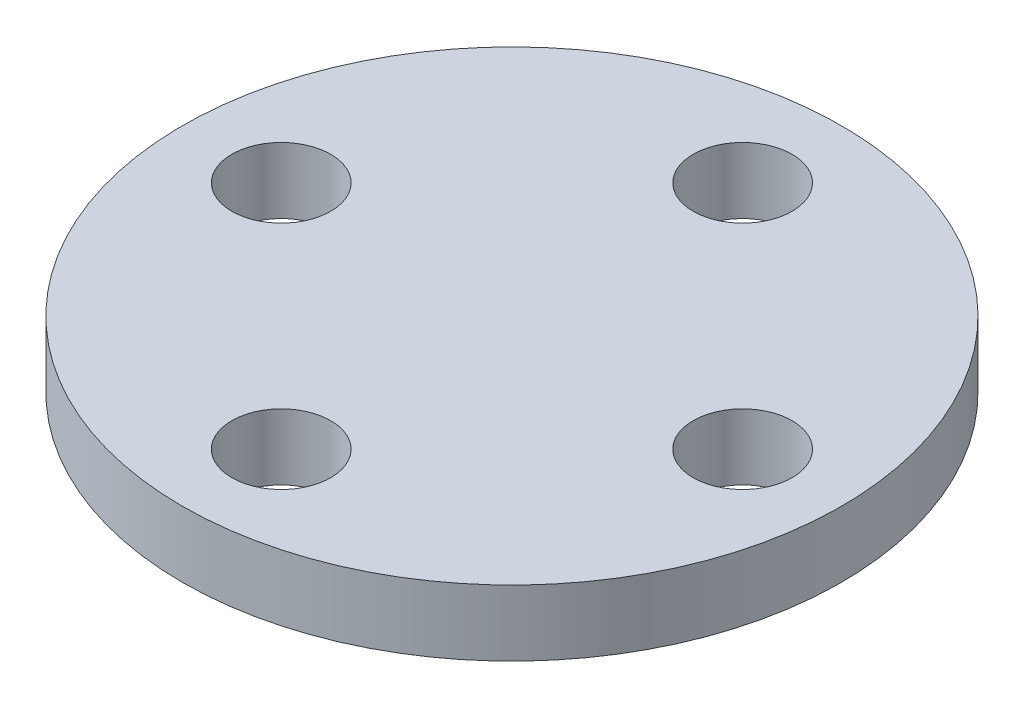
ISO-10303-21;
HEADER;
FILE_DESCRIPTION(('STEP AP214'),'2;1');
FILE_NAME('part.step','',(''),(''),'','','');
FILE_SCHEMA(('AUTOMOTIVE_DESIGN { 1 0 10303 214 1 1 1 1 }'));
ENDSEC;
DATA;
#1=APPLICATION_CONTEXT('core data for automotive mechanical design processes');
#2=APPLICATION_PROTOCOL_DEFINITION('international standard','automotive_design',2000,#1);
#3=PRODUCT_CONTEXT('',#1,'mechanical');
#4=PRODUCT('Part','Part','',(#3));
#5=PRODUCT_RELATED_PRODUCT_CATEGORY('part','',(#4));
#6=PRODUCT_DEFINITION_FORMATION('','',#4);
#7=PRODUCT_DEFINITION_CONTEXT('part definition',#1,'design');
#8=PRODUCT_DEFINITION('design','',#6,#7);
#9=PRODUCT_DEFINITION_SHAPE('','',#8);
#10=(LENGTH_UNIT() NAMED_UNIT(*) SI_UNIT(.MILLI.,.METRE.));
#11=(NAMED_UNIT(*) PLANE_ANGLE_UNIT() SI_UNIT($,.RADIAN.));
#12=(NAMED_UNIT(*) SI_UNIT($,.STERADIAN.) SOLID_ANGLE_UNIT());
#13=UNCERTAINTY_MEASURE_WITH_UNIT(LENGTH_MEASURE(1.E-05),#10,'distance_accuracy_value','');
#14=(GEOMETRIC_REPRESENTATION_CONTEXT(3) GLOBAL_UNCERTAINTY_ASSIGNED_CONTEXT((#13)) GLOBAL_UNIT_ASSIGNED_CONTEXT((#10,
#11,#12)) REPRESENTATION_CONTEXT('',''));
#15=CARTESIAN_POINT('',(0.,0.,0.));
#16=DIRECTION('',(0.,0.,1.));
#17=DIRECTION('',(1.,0.,0.));
#18=AXIS2_PLACEMENT_3D('',#15,#16,#17);
#19=CARTESIAN_POINT('',(0.,0.,0.));
#20=DIRECTION('',(0.,1.,0.));
#21=DIRECTION('',(0.,0.,1.));
#22=AXIS2_PLACEMENT_3D('',#19,#20,#21);
#23=PLANE('',#22);
#24=CARTESIAN_POINT('',(0.,0.,7.));
#25=DIRECTION('',(0.,1.,0.));
#26=DIRECTION('',(0.,0.,1.));
#27=AXIS2_PLACEMENT_3D('',#24,#25,#26);
#28=CIRCLE('',#27,1.5);
#29=CARTESIAN_POINT('',(0.,0.,8.5));
#30=VERTEX_POINT('',#29);
#31=EDGE_CURVE('E61',#30,#30,#28,.T.);
#32=ORIENTED_EDGE('',*,*,#31,.T.);
#33=EDGE_LOOP('',(#32));
#34=FACE_BOUND('',#33,.T.);
#35=CARTESIAN_POINT('',(0.,0.,-7.));
#36=DIRECTION('',(0.,1.,0.));
#37=DIRECTION('',(0.,0.,1.));
#38=AXIS2_PLACEMENT_3D('',#35,#36,#37);
#39=CIRCLE('',#38,1.5);
#40=CARTESIAN_POINT('',(0.,0.,-5.5));
#41=VERTEX_POINT('',#40);
#42=EDGE_CURVE('E49',#41,#41,#39,.T.);
#43=ORIENTED_EDGE('',*,*,#42,.T.);
#44=EDGE_LOOP('',(#43));
#45=FACE_BOUND('',#44,.T.);
#46=CARTESIAN_POINT('',(0.,0.,0.));
#47=DIRECTION('',(0.,1.,0.));
#48=DIRECTION('',(0.,0.,1.));
#49=AXIS2_PLACEMENT_3D('',#46,#47,#48);
#50=CIRCLE('',#49,10.);
#51=CARTESIAN_POINT('',(0.,0.,10.));
#52=VERTEX_POINT('',#51);
#53=EDGE_CURVE('E42',#52,#52,#50,.T.);
#54=ORIENTED_EDGE('',*,*,#53,.F.);
#55=EDGE_LOOP('',(#54));
#56=FACE_BOUND('',#55,.T.);
#57=CARTESIAN_POINT('',(7.,0.,0.));
#58=DIRECTION('',(0.,1.,0.));
#59=DIRECTION('',(0.,0.,1.));
#60=AXIS2_PLACEMENT_3D('',#57,#58,#59);
#61=CIRCLE('',#60,1.5);
#62=CARTESIAN_POINT('',(7.,0.,1.5));
#63=VERTEX_POINT('',#62);
#64=EDGE_CURVE('E55',#63,#63,#61,.T.);
#65=ORIENTED_EDGE('',*,*,#64,.T.);
#66=EDGE_LOOP('',(#65));
#67=FACE_BOUND('',#66,.T.);
#68=CARTESIAN_POINT('',(-7.,0.,0.));
#69=DIRECTION('',(0.,1.,0.));
#70=DIRECTION('',(0.,0.,1.));
#71=AXIS2_PLACEMENT_3D('',#68,#69,#70);
#72=CIRCLE('',#71,1.5);
#73=CARTESIAN_POINT('',(-7.,0.,1.5));
#74=VERTEX_POINT('',#73);
#75=EDGE_CURVE('E67',#74,#74,#72,.T.);
#76=ORIENTED_EDGE('',*,*,#75,.T.);
#77=EDGE_LOOP('',(#76));
#78=FACE_BOUND('',#77,.T.);
#79=CARTESIAN_POINT('',(0.,0.,0.));
#80=DIRECTION('',(0.,1.,0.));
#81=DIRECTION('',(0.,0.,1.));
#82=AXIS2_PLACEMENT_3D('',#79,#80,#81);
#83=CIRCLE('',#82,4.);
#84=CARTESIAN_POINT('',(0.,0.,4.));
#85=VERTEX_POINT('',#84);
#86=EDGE_CURVE('E10',#85,#85,#83,.F.);
#87=ORIENTED_EDGE('',*,*,#86,.F.);
#88=EDGE_LOOP('',(#87));
#89=FACE_BOUND('',#88,.T.);
#90=ADVANCED_FACE('F31',(#34,#45,#56,#67,#78,#89),#23,.F.);
#91=CARTESIAN_POINT('',(0.,2.,0.));
#92=DIRECTION('',(0.,1.,0.));
#93=DIRECTION('',(0.,0.,1.));
#94=AXIS2_PLACEMENT_3D('',#91,#92,#93);
#95=PLANE('',#94);
#96=CARTESIAN_POINT('',(0.,2.,7.));
#97=DIRECTION('',(0.,1.,0.));
#98=DIRECTION('',(0.,0.,1.));
#99=AXIS2_PLACEMENT_3D('',#96,#97,#98);
#100=CIRCLE('',#99,1.5);
#101=CARTESIAN_POINT('',(0.,2.,8.5));
#102=VERTEX_POINT('',#101);
#103=EDGE_CURVE('E58',#102,#102,#100,.T.);
#104=ORIENTED_EDGE('',*,*,#103,.F.);
#105=EDGE_LOOP('',(#104));
#106=FACE_BOUND('',#105,.T.);
#107=CARTESIAN_POINT('',(0.,2.,-7.));
#108=DIRECTION('',(0.,1.,0.));
#109=DIRECTION('',(0.,0.,1.));
#110=AXIS2_PLACEMENT_3D('',#107,#108,#109);
#111=CIRCLE('',#110,1.5);
#112=CARTESIAN_POINT('',(0.,2.,-5.5));
#113=VERTEX_POINT('',#112);
#114=EDGE_CURVE('E47',#113,#113,#111,.T.);
#115=ORIENTED_EDGE('',*,*,#114,.F.);
#116=EDGE_LOOP('',(#115));
#117=FACE_BOUND('',#116,.T.);
#118=CARTESIAN_POINT('',(0.,2.,0.));
#119=DIRECTION('',(0.,1.,0.));
#120=DIRECTION('',(0.,0.,1.));
#121=AXIS2_PLACEMENT_3D('',#118,#119,#120);
#122=CIRCLE('',#121,10.);
#123=CARTESIAN_POINT('',(0.,2.,10.));
#124=VERTEX_POINT('',#123);
#125=EDGE_CURVE('E38',#124,#124,#122,.T.);
#126=ORIENTED_EDGE('',*,*,#125,.T.);
#127=EDGE_LOOP('',(#126));
#128=FACE_BOUND('',#127,.T.);
#129=CARTESIAN_POINT('',(7.,2.,0.));
#130=DIRECTION('',(0.,1.,0.));
#131=DIRECTION('',(0.,0.,1.));
#132=AXIS2_PLACEMENT_3D('',#129,#130,#131);
#133=CIRCLE('',#132,1.5);
#134=CARTESIAN_POINT('',(7.,2.,1.5));
#135=VERTEX_POINT('',#134);
#136=EDGE_CURVE('E52',#135,#135,#133,.T.);
#137=ORIENTED_EDGE('',*,*,#136,.F.);
#138=EDGE_LOOP('',(#137));
#139=FACE_BOUND('',#138,.T.);
#140=CARTESIAN_POINT('',(-7.,2.,0.));
#141=DIRECTION('',(0.,1.,0.));
#142=DIRECTION('',(0.,0.,1.));
#143=AXIS2_PLACEMENT_3D('',#140,#141,#142);
#144=CIRCLE('',#143,1.5);
#145=CARTESIAN_POINT('',(-7.,2.,1.5));
#146=VERTEX_POINT('',#145);
#147=EDGE_CURVE('E64',#146,#146,#144,.T.);
#148=ORIENTED_EDGE('',*,*,#147,.F.);
#149=EDGE_LOOP('',(#148));
#150=FACE_BOUND('',#149,.T.);
#151=ADVANCED_FACE('F102',(#106,#117,#128,#139,#150),#95,.T.);
#152=CARTESIAN_POINT('',(0.,2.,0.));
#153=DIRECTION('',(0.,-1.,0.));
#154=DIRECTION('',(0.,0.,-1.));
#155=AXIS2_PLACEMENT_3D('',#152,#153,#154);
#156=CYLINDRICAL_SURFACE('',#155,10.);
#157=ORIENTED_EDGE('',*,*,#125,.F.);
#158=EDGE_LOOP('',(#157));
#159=FACE_BOUND('',#158,.T.);
#160=ORIENTED_EDGE('',*,*,#53,.T.);
#161=EDGE_LOOP('',(#160));
#162=FACE_BOUND('',#161,.T.);
#163=ADVANCED_FACE('F33',(#159,#162),#156,.T.);
#164=CARTESIAN_POINT('',(0.,2.,-7.));
#165=DIRECTION('',(0.,-1.,0.));
#166=DIRECTION('',(0.,0.,-1.));
#167=AXIS2_PLACEMENT_3D('',#164,#165,#166);
#168=CYLINDRICAL_SURFACE('',#167,1.5);
#169=ORIENTED_EDGE('',*,*,#114,.T.);
#170=EDGE_LOOP('',(#169));
#171=FACE_BOUND('',#170,.T.);
#172=ORIENTED_EDGE('',*,*,#42,.F.);
#173=EDGE_LOOP('',(#172));
#174=FACE_BOUND('',#173,.T.);
#175=ADVANCED_FACE('F156',(#171,#174),#168,.F.);
#176=CARTESIAN_POINT('',(7.,2.,0.));
#177=DIRECTION('',(0.,-1.,0.));
#178=DIRECTION('',(0.,0.,-1.));
#179=AXIS2_PLACEMENT_3D('',#176,#177,#178);
#180=CYLINDRICAL_SURFACE('',#179,1.5);
#181=ORIENTED_EDGE('',*,*,#136,.T.);
#182=EDGE_LOOP('',(#181));
#183=FACE_BOUND('',#182,.T.);
#184=ORIENTED_EDGE('',*,*,#64,.F.);
#185=EDGE_LOOP('',(#184));
#186=FACE_BOUND('',#185,.T.);
#187=ADVANCED_FACE('F146',(#183,#186),#180,.F.);
#188=CARTESIAN_POINT('',(0.,2.,7.));
#189=DIRECTION('',(0.,-1.,0.));
#190=DIRECTION('',(0.,0.,-1.));
#191=AXIS2_PLACEMENT_3D('',#188,#189,#190);
#192=CYLINDRICAL_SURFACE('',#191,1.5);
#193=ORIENTED_EDGE('',*,*,#103,.T.);
#194=EDGE_LOOP('',(#193));
#195=FACE_BOUND('',#194,.T.);
#196=ORIENTED_EDGE('',*,*,#31,.F.);
#197=EDGE_LOOP('',(#196));
#198=FACE_BOUND('',#197,.T.);
#199=ADVANCED_FACE('F97',(#195,#198),#192,.F.);
#200=CARTESIAN_POINT('',(-7.,2.,0.));
#201=DIRECTION('',(0.,-1.,0.));
#202=DIRECTION('',(0.,0.,-1.));
#203=AXIS2_PLACEMENT_3D('',#200,#201,#202);
#204=CYLINDRICAL_SURFACE('',#203,1.5);
#205=ORIENTED_EDGE('',*,*,#147,.T.);
#206=EDGE_LOOP('',(#205));
#207=FACE_BOUND('',#206,.T.);
#208=ORIENTED_EDGE('',*,*,#75,.F.);
#209=EDGE_LOOP('',(#208));
#210=FACE_BOUND('',#209,.T.);
#211=ADVANCED_FACE('F88',(#207,#210),#204,.F.);
#212=CARTESIAN_POINT('',(0.,-3.,0.));
#213=DIRECTION('',(0.,-1.,0.));
#214=DIRECTION('',(0.,0.,-1.));
#215=AXIS2_PLACEMENT_3D('',#212,#213,#214);
#216=PLANE('',#215);
#217=CARTESIAN_POINT('',(0.,-3.,0.));
#218=DIRECTION('',(0.,-1.,0.));
#219=DIRECTION('',(0.,0.,-1.));
#220=AXIS2_PLACEMENT_3D('',#217,#218,#219);
#221=CIRCLE('',#220,4.);
#222=CARTESIAN_POINT('',(0.,-3.,-4.));
#223=VERTEX_POINT('',#222);
#224=EDGE_CURVE('E70',#223,#223,#221,.T.);
#225=ORIENTED_EDGE('',*,*,#224,.T.);
#226=EDGE_LOOP('',(#225));
#227=FACE_BOUND('',#226,.T.);
#228=CARTESIAN_POINT('',(0.,-3.,0.));
#229=DIRECTION('',(0.,-1.,0.));
#230=DIRECTION('',(0.,0.,-1.));
#231=AXIS2_PLACEMENT_3D('',#228,#229,#230);
#232=CIRCLE('',#231,2.);
#233=CARTESIAN_POINT('',(0.,-3.,-2.));
#234=VERTEX_POINT('',#233);
#235=EDGE_CURVE('E75',#234,#234,#232,.T.);
#236=ORIENTED_EDGE('',*,*,#235,.F.);
#237=EDGE_LOOP('',(#236));
#238=FACE_BOUND('',#237,.T.);
#239=ADVANCED_FACE('F85',(#227,#238),#216,.T.);
#240=CARTESIAN_POINT('',(0.,-3.,0.));
#241=DIRECTION('',(0.,1.,0.));
#242=DIRECTION('',(0.,0.,1.));
#243=AXIS2_PLACEMENT_3D('',#240,#241,#242);
#244=CYLINDRICAL_SURFACE('',#243,4.);
#245=ORIENTED_EDGE('',*,*,#224,.F.);
#246=EDGE_LOOP('',(#245));
#247=FACE_BOUND('',#246,.T.);
#248=ORIENTED_EDGE('',*,*,#86,.T.);
#249=EDGE_LOOP('',(#248));
#250=FACE_BOUND('',#249,.T.);
#251=ADVANCED_FACE('F87',(#247,#250),#244,.T.);
#252=CARTESIAN_POINT('',(0.,-3.,0.));
#253=DIRECTION('',(0.,1.,0.));
#254=DIRECTION('',(0.,0.,1.));
#255=AXIS2_PLACEMENT_3D('',#252,#253,#254);
#256=CYLINDRICAL_SURFACE('',#255,2.);
#257=ORIENTED_EDGE('',*,*,#235,.T.);
#258=EDGE_LOOP('',(#257));
#259=FACE_BOUND('',#258,.T.);
#260=CARTESIAN_POINT('',(0.,0.,0.));
#261=DIRECTION('',(0.,-1.,0.));
#262=DIRECTION('',(0.,0.,-1.));
#263=AXIS2_PLACEMENT_3D('',#260,#261,#262);
#264=CIRCLE('',#263,2.);
#265=CARTESIAN_POINT('',(0.,0.,-2.));
#266=VERTEX_POINT('',#265);
#267=EDGE_CURVE('E76',#266,#266,#264,.T.);
#268=ORIENTED_EDGE('',*,*,#267,.F.);
#269=EDGE_LOOP('',(#268));
#270=FACE_BOUND('',#269,.T.);
#271=ADVANCED_FACE('F82',(#259,#270),#256,.F.);
#272=ORIENTED_EDGE('',*,*,#267,.T.);
#273=EDGE_LOOP('',(#272));
#274=FACE_BOUND('',#273,.T.);
#275=ADVANCED_FACE('F104',(#274),#23,.F.);
#276=CLOSED_SHELL('',(#90,#151,#163,#175,#187,#199,#211,#239,#251,#271,#275));
#277=MANIFOLD_SOLID_BREP('B2',#276);
#278=ADVANCED_BREP_SHAPE_REPRESENTATION('',(#18,#277),#14);
#279=SHAPE_DEFINITION_REPRESENTATION(#9,#278);
ENDSEC;
END-ISO-10303-21;
